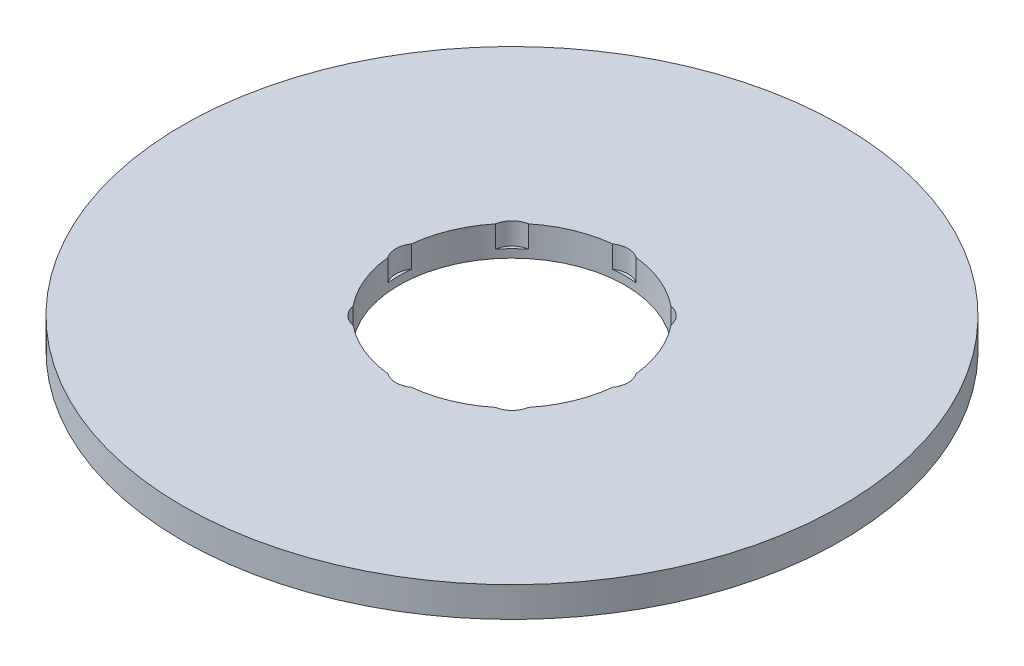
ISO-10303-21;
HEADER;
FILE_DESCRIPTION(('STEP AP214'),'2;1');
FILE_NAME('part.step','',(''),(''),'','','');
FILE_SCHEMA(('AUTOMOTIVE_DESIGN { 1 0 10303 214 1 1 1 1 }'));
ENDSEC;
DATA;
#1=APPLICATION_CONTEXT('core data for automotive mechanical design processes');
#2=APPLICATION_PROTOCOL_DEFINITION('international standard','automotive_design',2000,#1);
#3=PRODUCT_CONTEXT('',#1,'mechanical');
#4=PRODUCT('Part','Part','',(#3));
#5=PRODUCT_RELATED_PRODUCT_CATEGORY('part','',(#4));
#6=PRODUCT_DEFINITION_FORMATION('','',#4);
#7=PRODUCT_DEFINITION_CONTEXT('part definition',#1,'design');
#8=PRODUCT_DEFINITION('design','',#6,#7);
#9=PRODUCT_DEFINITION_SHAPE('','',#8);
#10=(LENGTH_UNIT() NAMED_UNIT(*) SI_UNIT(.MILLI.,.METRE.));
#11=(NAMED_UNIT(*) PLANE_ANGLE_UNIT() SI_UNIT($,.RADIAN.));
#12=(NAMED_UNIT(*) SI_UNIT($,.STERADIAN.) SOLID_ANGLE_UNIT());
#13=UNCERTAINTY_MEASURE_WITH_UNIT(LENGTH_MEASURE(1.E-05),#10,'distance_accuracy_value','');
#14=(GEOMETRIC_REPRESENTATION_CONTEXT(3) GLOBAL_UNCERTAINTY_ASSIGNED_CONTEXT((#13)) GLOBAL_UNIT_ASSIGNED_CONTEXT((#10,
#11,#12)) REPRESENTATION_CONTEXT('',''));
#15=CARTESIAN_POINT('',(0.,0.,0.));
#16=DIRECTION('',(0.,0.,1.));
#17=DIRECTION('',(1.,0.,0.));
#18=AXIS2_PLACEMENT_3D('',#15,#16,#17);
#19=CARTESIAN_POINT('',(0.,8.,0.));
#20=DIRECTION('',(0.,-1.,0.));
#21=DIRECTION('',(0.,0.,-1.));
#22=AXIS2_PLACEMENT_3D('',#19,#20,#21);
#23=CYLINDRICAL_SURFACE('',#22,87.5);
#24=CARTESIAN_POINT('',(0.,8.,0.));
#25=DIRECTION('',(0.,1.,0.));
#26=DIRECTION('',(0.,0.,1.));
#27=AXIS2_PLACEMENT_3D('',#24,#25,#26);
#28=CIRCLE('',#27,87.5);
#29=CARTESIAN_POINT('',(0.,8.,87.5));
#30=VERTEX_POINT('',#29);
#31=EDGE_CURVE('E183',#30,#30,#28,.T.);
#32=ORIENTED_EDGE('',*,*,#31,.F.);
#33=EDGE_LOOP('',(#32));
#34=FACE_BOUND('',#33,.T.);
#35=CARTESIAN_POINT('',(0.,0.,0.));
#36=DIRECTION('',(0.,1.,0.));
#37=DIRECTION('',(0.,0.,1.));
#38=AXIS2_PLACEMENT_3D('',#35,#36,#37);
#39=CIRCLE('',#38,87.5);
#40=CARTESIAN_POINT('',(0.,0.,87.5));
#41=VERTEX_POINT('',#40);
#42=EDGE_CURVE('E182',#41,#41,#39,.T.);
#43=ORIENTED_EDGE('',*,*,#42,.T.);
#44=EDGE_LOOP('',(#43));
#45=FACE_BOUND('',#44,.T.);
#46=ADVANCED_FACE('F39',(#34,#45),#23,.T.);
#47=CARTESIAN_POINT('',(0.,8.,0.));
#48=DIRECTION('',(0.,1.,0.));
#49=DIRECTION('',(0.,0.,1.));
#50=AXIS2_PLACEMENT_3D('',#47,#48,#49);
#51=PLANE('',#50);
#52=CARTESIAN_POINT('',(0.,8.,25.4752895395327));
#53=DIRECTION('',(0.,1.,0.));
#54=DIRECTION('',(1.,0.,0.));
#55=AXIS2_PLACEMENT_3D('',#52,#53,#54);
#56=CIRCLE('',#55,5.35674444251532);
#57=CARTESIAN_POINT('',(-3.10740063924162,8.,29.838633703091));
#58=VERTEX_POINT('',#57);
#59=CARTESIAN_POINT('',(3.10740063924183,8.,29.838633703091));
#60=VERTEX_POINT('',#59);
#61=EDGE_CURVE('E256',#58,#60,#56,.T.);
#62=ORIENTED_EDGE('',*,*,#61,.F.);
#63=CARTESIAN_POINT('',(0.,8.,0.));
#64=DIRECTION('',(0.,1.,0.));
#65=DIRECTION('',(0.,0.,1.));
#66=AXIS2_PLACEMENT_3D('',#63,#64,#65);
#67=CIRCLE('',#66,30.);
#68=CARTESIAN_POINT('',(-18.9018361689258,8.,23.2963642966684));
#69=VERTEX_POINT('',#68);
#70=EDGE_CURVE('E175',#69,#58,#67,.T.);
#71=ORIENTED_EDGE('',*,*,#70,.F.);
#72=CARTESIAN_POINT('',(-18.0137499860942,8.,18.0137499860943));
#73=DIRECTION('',(0.,1.,0.));
#74=DIRECTION('',(0.707106781186549,0.,0.707106781186546));
#75=AXIS2_PLACEMENT_3D('',#72,#73,#74);
#76=CIRCLE('',#75,5.35674444251532);
#77=CARTESIAN_POINT('',(-23.2963642966683,8.,18.9018361689259));
#78=VERTEX_POINT('',#77);
#79=EDGE_CURVE('E152',#78,#69,#76,.T.);
#80=ORIENTED_EDGE('',*,*,#79,.F.);
#81=CARTESIAN_POINT('',(-29.838633703091,8.,3.10740063924173));
#82=VERTEX_POINT('',#81);
#83=EDGE_CURVE('E168',#82,#78,#67,.T.);
#84=ORIENTED_EDGE('',*,*,#83,.F.);
#85=CARTESIAN_POINT('',(-25.4752895395327,8.,0.));
#86=DIRECTION('',(0.,1.,0.));
#87=DIRECTION('',(0.,0.,1.));
#88=AXIS2_PLACEMENT_3D('',#85,#86,#87);
#89=CIRCLE('',#88,5.35674444251532);
#90=CARTESIAN_POINT('',(-29.838633703091,8.,-3.10740063924173));
#91=VERTEX_POINT('',#90);
#92=EDGE_CURVE('E205',#91,#82,#89,.T.);
#93=ORIENTED_EDGE('',*,*,#92,.F.);
#94=CARTESIAN_POINT('',(-23.2963642966686,8.,-18.9018361689256));
#95=VERTEX_POINT('',#94);
#96=EDGE_CURVE('E181',#95,#91,#67,.T.);
#97=ORIENTED_EDGE('',*,*,#96,.F.);
#98=CARTESIAN_POINT('',(-18.0137499860945,8.,-18.013749986094));
#99=DIRECTION('',(0.,1.,0.));
#100=DIRECTION('',(-0.707106781186539,0.,0.707106781186556));
#101=AXIS2_PLACEMENT_3D('',#98,#99,#100);
#102=CIRCLE('',#101,5.35674444251532);
#103=CARTESIAN_POINT('',(-18.9018361689262,8.,-23.2963642966681));
#104=VERTEX_POINT('',#103);
#105=EDGE_CURVE('E453',#104,#95,#102,.T.);
#106=ORIENTED_EDGE('',*,*,#105,.F.);
#107=CARTESIAN_POINT('',(-3.10740063924204,8.,-29.838633703091));
#108=VERTEX_POINT('',#107);
#109=EDGE_CURVE('E189',#108,#104,#67,.T.);
#110=ORIENTED_EDGE('',*,*,#109,.F.);
#111=CARTESIAN_POINT('',(-2.66839494086712E-13,8.,-25.4752895395327));
#112=DIRECTION('',(0.,1.,0.));
#113=DIRECTION('',(-1.,0.,0.));
#114=AXIS2_PLACEMENT_3D('',#111,#112,#113);
#115=CIRCLE('',#114,5.35674444251532);
#116=CARTESIAN_POINT('',(3.10740063924142,8.,-29.8386337030911));
#117=VERTEX_POINT('',#116);
#118=EDGE_CURVE('E462',#117,#108,#115,.T.);
#119=ORIENTED_EDGE('',*,*,#118,.F.);
#120=CARTESIAN_POINT('',(18.9018361689257,8.,-23.2963642966685));
#121=VERTEX_POINT('',#120);
#122=EDGE_CURVE('E197',#121,#117,#67,.T.);
#123=ORIENTED_EDGE('',*,*,#122,.F.);
#124=CARTESIAN_POINT('',(18.0137499860941,8.,-18.0137499860944));
#125=DIRECTION('',(0.,1.,0.));
#126=DIRECTION('',(-0.707106781186554,0.,-0.707106781186541));
#127=AXIS2_PLACEMENT_3D('',#124,#125,#126);
#128=CIRCLE('',#127,5.35674444251532);
#129=CARTESIAN_POINT('',(23.2963642966682,8.,-18.9018361689261));
#130=VERTEX_POINT('',#129);
#131=EDGE_CURVE('E470',#130,#121,#128,.T.);
#132=ORIENTED_EDGE('',*,*,#131,.F.);
#133=CARTESIAN_POINT('',(29.838633703091,8.,-3.10740063924173));
#134=VERTEX_POINT('',#133);
#135=EDGE_CURVE('E489',#134,#130,#67,.T.);
#136=ORIENTED_EDGE('',*,*,#135,.F.);
#137=CARTESIAN_POINT('',(25.4752895395327,8.,0.));
#138=DIRECTION('',(0.,1.,0.));
#139=DIRECTION('',(0.,0.,-1.));
#140=AXIS2_PLACEMENT_3D('',#137,#138,#139);
#141=CIRCLE('',#140,5.35674444251532);
#142=CARTESIAN_POINT('',(29.838633703091,8.,3.10740063924173));
#143=VERTEX_POINT('',#142);
#144=EDGE_CURVE('E476',#143,#134,#141,.T.);
#145=ORIENTED_EDGE('',*,*,#144,.F.);
#146=CARTESIAN_POINT('',(23.2963642966685,8.,18.9018361689258));
#147=VERTEX_POINT('',#146);
#148=EDGE_CURVE('E491',#147,#143,#67,.T.);
#149=ORIENTED_EDGE('',*,*,#148,.F.);
#150=CARTESIAN_POINT('',(18.0137499860944,8.,18.0137499860942));
#151=DIRECTION('',(0.,1.,0.));
#152=DIRECTION('',(0.707106781186544,0.,-0.707106781186551));
#153=AXIS2_PLACEMENT_3D('',#150,#151,#152);
#154=CIRCLE('',#153,5.35674444251532);
#155=CARTESIAN_POINT('',(18.901836168926,8.,23.2963642966683));
#156=VERTEX_POINT('',#155);
#157=EDGE_CURVE('E475',#156,#147,#154,.T.);
#158=ORIENTED_EDGE('',*,*,#157,.F.);
#159=EDGE_CURVE('E190',#60,#156,#67,.T.);
#160=ORIENTED_EDGE('',*,*,#159,.F.);
#161=EDGE_LOOP('',(#62,#71,#80,#84,#93,#97,#106,#110,#119,#123,#132,#136,#145,#149,#158,#160));
#162=FACE_BOUND('',#161,.T.);
#163=ORIENTED_EDGE('',*,*,#31,.T.);
#164=EDGE_LOOP('',(#163));
#165=FACE_BOUND('',#164,.T.);
#166=ADVANCED_FACE('F170',(#162,#165),#51,.T.);
#167=CARTESIAN_POINT('',(0.,0.,0.));
#168=DIRECTION('',(0.,1.,0.));
#169=DIRECTION('',(0.,0.,1.));
#170=AXIS2_PLACEMENT_3D('',#167,#168,#169);
#171=PLANE('',#170);
#172=CARTESIAN_POINT('',(0.,0.,0.));
#173=DIRECTION('',(0.,1.,0.));
#174=DIRECTION('',(0.,0.,1.));
#175=AXIS2_PLACEMENT_3D('',#172,#173,#174);
#176=CIRCLE('',#175,30.);
#177=CARTESIAN_POINT('',(0.,0.,30.));
#178=VERTEX_POINT('',#177);
#179=EDGE_CURVE('E191',#178,#178,#176,.T.);
#180=ORIENTED_EDGE('',*,*,#179,.T.);
#181=EDGE_LOOP('',(#180));
#182=FACE_BOUND('',#181,.T.);
#183=ORIENTED_EDGE('',*,*,#42,.F.);
#184=EDGE_LOOP('',(#183));
#185=FACE_BOUND('',#184,.T.);
#186=ADVANCED_FACE('F277',(#182,#185),#171,.F.);
#187=CARTESIAN_POINT('',(0.,8.,0.));
#188=DIRECTION('',(0.,-1.,0.));
#189=DIRECTION('',(0.,0.,-1.));
#190=AXIS2_PLACEMENT_3D('',#187,#188,#189);
#191=CYLINDRICAL_SURFACE('',#190,30.);
#192=DIRECTION('',(0.,1.,0.));
#193=VECTOR('',#192,1.);
#194=CARTESIAN_POINT('',(-3.10740063924164,5.08695155469688,29.838633703091));
#195=LINE('',#194,#193);
#196=CARTESIAN_POINT('',(-3.10740063924162,2.17390310939375,29.838633703091));
#197=VERTEX_POINT('',#196);
#198=EDGE_CURVE('E11',#197,#58,#195,.T.);
#199=ORIENTED_EDGE('',*,*,#198,.F.);
#200=CARTESIAN_POINT('',(0.,2.17390310939375,0.));
#201=DIRECTION('',(0.,1.,0.));
#202=DIRECTION('',(0.,0.,1.));
#203=AXIS2_PLACEMENT_3D('',#200,#201,#202);
#204=CIRCLE('',#203,30.);
#205=CARTESIAN_POINT('',(3.10740063924183,2.17390310939375,29.838633703091));
#206=VERTEX_POINT('',#205);
#207=EDGE_CURVE('E251',#197,#206,#204,.T.);
#208=ORIENTED_EDGE('',*,*,#207,.T.);
#209=DIRECTION('',(0.,1.,0.));
#210=VECTOR('',#209,1.);
#211=CARTESIAN_POINT('',(3.10740063924185,5.08695155469688,29.838633703091));
#212=LINE('',#211,#210);
#213=EDGE_CURVE('E46',#60,#206,#212,.F.);
#214=ORIENTED_EDGE('',*,*,#213,.F.);
#215=ORIENTED_EDGE('',*,*,#159,.T.);
#216=DIRECTION('',(0.,1.,0.));
#217=VECTOR('',#216,1.);
#218=CARTESIAN_POINT('',(18.901836168926,5.08695155469688,23.2963642966683));
#219=LINE('',#218,#217);
#220=CARTESIAN_POINT('',(18.901836168926,2.17390310939375,23.2963642966683));
#221=VERTEX_POINT('',#220);
#222=EDGE_CURVE('E253',#221,#156,#219,.T.);
#223=ORIENTED_EDGE('',*,*,#222,.F.);
#224=CARTESIAN_POINT('',(0.,2.17390310939375,0.));
#225=DIRECTION('',(0.,1.,0.));
#226=DIRECTION('',(0.,0.,1.));
#227=AXIS2_PLACEMENT_3D('',#224,#225,#226);
#228=CIRCLE('',#227,30.);
#229=CARTESIAN_POINT('',(23.2963642966685,2.17390310939375,18.9018361689258));
#230=VERTEX_POINT('',#229);
#231=EDGE_CURVE('E246',#221,#230,#228,.T.);
#232=ORIENTED_EDGE('',*,*,#231,.T.);
#233=DIRECTION('',(0.,1.,0.));
#234=VECTOR('',#233,1.);
#235=CARTESIAN_POINT('',(23.2963642966685,5.08695155469688,18.9018361689258));
#236=LINE('',#235,#234);
#237=EDGE_CURVE('E248',#147,#230,#236,.F.);
#238=ORIENTED_EDGE('',*,*,#237,.F.);
#239=ORIENTED_EDGE('',*,*,#148,.T.);
#240=DIRECTION('',(0.,1.,0.));
#241=VECTOR('',#240,1.);
#242=CARTESIAN_POINT('',(29.838633703091,5.08695155469688,3.10740063924174));
#243=LINE('',#242,#241);
#244=CARTESIAN_POINT('',(29.838633703091,2.17390310939375,3.10740063924173));
#245=VERTEX_POINT('',#244);
#246=EDGE_CURVE('E243',#245,#143,#243,.T.);
#247=ORIENTED_EDGE('',*,*,#246,.F.);
#248=CARTESIAN_POINT('',(0.,2.17390310939375,0.));
#249=DIRECTION('',(0.,1.,0.));
#250=DIRECTION('',(0.,0.,1.));
#251=AXIS2_PLACEMENT_3D('',#248,#249,#250);
#252=CIRCLE('',#251,30.);
#253=CARTESIAN_POINT('',(29.838633703091,2.17390310939375,-3.10740063924173));
#254=VERTEX_POINT('',#253);
#255=EDGE_CURVE('E236',#245,#254,#252,.T.);
#256=ORIENTED_EDGE('',*,*,#255,.T.);
#257=DIRECTION('',(0.,1.,0.));
#258=VECTOR('',#257,1.);
#259=CARTESIAN_POINT('',(29.838633703091,5.08695155469688,-3.10740063924174));
#260=LINE('',#259,#258);
#261=EDGE_CURVE('E241',#134,#254,#260,.F.);
#262=ORIENTED_EDGE('',*,*,#261,.F.);
#263=ORIENTED_EDGE('',*,*,#135,.T.);
#264=DIRECTION('',(0.,1.,0.));
#265=VECTOR('',#264,1.);
#266=CARTESIAN_POINT('',(23.2963642966682,5.08695155469688,-18.9018361689261));
#267=LINE('',#266,#265);
#268=CARTESIAN_POINT('',(23.2963642966682,2.17390310939375,-18.9018361689261));
#269=VERTEX_POINT('',#268);
#270=EDGE_CURVE('E237',#269,#130,#267,.T.);
#271=ORIENTED_EDGE('',*,*,#270,.F.);
#272=CARTESIAN_POINT('',(0.,2.17390310939375,0.));
#273=DIRECTION('',(0.,1.,0.));
#274=DIRECTION('',(0.,0.,1.));
#275=AXIS2_PLACEMENT_3D('',#272,#273,#274);
#276=CIRCLE('',#275,30.);
#277=CARTESIAN_POINT('',(18.9018361689257,2.17390310939375,-23.2963642966685));
#278=VERTEX_POINT('',#277);
#279=EDGE_CURVE('E229',#269,#278,#276,.T.);
#280=ORIENTED_EDGE('',*,*,#279,.T.);
#281=DIRECTION('',(0.,1.,0.));
#282=VECTOR('',#281,1.);
#283=CARTESIAN_POINT('',(18.9018361689257,5.08695155469688,-23.2963642966685));
#284=LINE('',#283,#282);
#285=EDGE_CURVE('E232',#121,#278,#284,.F.);
#286=ORIENTED_EDGE('',*,*,#285,.F.);
#287=ORIENTED_EDGE('',*,*,#122,.T.);
#288=DIRECTION('',(0.,1.,0.));
#289=VECTOR('',#288,1.);
#290=CARTESIAN_POINT('',(3.10740063924143,5.08695155469688,-29.8386337030911));
#291=LINE('',#290,#289);
#292=CARTESIAN_POINT('',(3.10740063924142,2.17390310939375,-29.8386337030911));
#293=VERTEX_POINT('',#292);
#294=EDGE_CURVE('E227',#293,#117,#291,.T.);
#295=ORIENTED_EDGE('',*,*,#294,.F.);
#296=CARTESIAN_POINT('',(0.,2.17390310939375,0.));
#297=DIRECTION('',(0.,1.,0.));
#298=DIRECTION('',(0.,0.,1.));
#299=AXIS2_PLACEMENT_3D('',#296,#297,#298);
#300=CIRCLE('',#299,30.);
#301=CARTESIAN_POINT('',(-3.10740063924204,2.17390310939375,-29.838633703091));
#302=VERTEX_POINT('',#301);
#303=EDGE_CURVE('E225',#293,#302,#300,.T.);
#304=ORIENTED_EDGE('',*,*,#303,.T.);
#305=DIRECTION('',(0.,1.,0.));
#306=VECTOR('',#305,1.);
#307=CARTESIAN_POINT('',(-3.10740063924206,5.08695155469688,-29.838633703091));
#308=LINE('',#307,#306);
#309=EDGE_CURVE('E223',#108,#302,#308,.F.);
#310=ORIENTED_EDGE('',*,*,#309,.F.);
#311=ORIENTED_EDGE('',*,*,#109,.T.);
#312=DIRECTION('',(0.,1.,0.));
#313=VECTOR('',#312,1.);
#314=CARTESIAN_POINT('',(-18.9018361689262,5.08695155469688,-23.2963642966681));
#315=LINE('',#314,#313);
#316=CARTESIAN_POINT('',(-18.9018361689262,2.17390310939375,-23.2963642966681));
#317=VERTEX_POINT('',#316);
#318=EDGE_CURVE('E219',#317,#104,#315,.T.);
#319=ORIENTED_EDGE('',*,*,#318,.F.);
#320=CARTESIAN_POINT('',(0.,2.17390310939375,0.));
#321=DIRECTION('',(0.,1.,0.));
#322=DIRECTION('',(0.,0.,1.));
#323=AXIS2_PLACEMENT_3D('',#320,#321,#322);
#324=CIRCLE('',#323,30.);
#325=CARTESIAN_POINT('',(-23.2963642966686,2.17390310939375,-18.9018361689256));
#326=VERTEX_POINT('',#325);
#327=EDGE_CURVE('E159',#317,#326,#324,.T.);
#328=ORIENTED_EDGE('',*,*,#327,.T.);
#329=DIRECTION('',(0.,1.,0.));
#330=VECTOR('',#329,1.);
#331=CARTESIAN_POINT('',(-23.2963642966686,5.08695155469688,-18.9018361689256));
#332=LINE('',#331,#330);
#333=EDGE_CURVE('E220',#95,#326,#332,.F.);
#334=ORIENTED_EDGE('',*,*,#333,.F.);
#335=ORIENTED_EDGE('',*,*,#96,.T.);
#336=DIRECTION('',(0.,1.,0.));
#337=VECTOR('',#336,1.);
#338=CARTESIAN_POINT('',(-29.838633703091,5.08695155469688,-3.10740063924174));
#339=LINE('',#338,#337);
#340=CARTESIAN_POINT('',(-29.838633703091,2.17390310939375,-3.10740063924173));
#341=VERTEX_POINT('',#340);
#342=EDGE_CURVE('E209',#341,#91,#339,.T.);
#343=ORIENTED_EDGE('',*,*,#342,.F.);
#344=CARTESIAN_POINT('',(0.,2.17390310939375,0.));
#345=DIRECTION('',(0.,1.,0.));
#346=DIRECTION('',(0.,0.,1.));
#347=AXIS2_PLACEMENT_3D('',#344,#345,#346);
#348=CIRCLE('',#347,30.);
#349=CARTESIAN_POINT('',(-29.838633703091,2.17390310939375,3.10740063924173));
#350=VERTEX_POINT('',#349);
#351=EDGE_CURVE('E206',#341,#350,#348,.T.);
#352=ORIENTED_EDGE('',*,*,#351,.T.);
#353=DIRECTION('',(0.,1.,0.));
#354=VECTOR('',#353,1.);
#355=CARTESIAN_POINT('',(-29.838633703091,5.08695155469688,3.10740063924174));
#356=LINE('',#355,#354);
#357=EDGE_CURVE('E179',#82,#350,#356,.F.);
#358=ORIENTED_EDGE('',*,*,#357,.F.);
#359=ORIENTED_EDGE('',*,*,#83,.T.);
#360=DIRECTION('',(0.,1.,0.));
#361=VECTOR('',#360,1.);
#362=CARTESIAN_POINT('',(-23.2963642966683,5.08695155469688,18.9018361689259));
#363=LINE('',#362,#361);
#364=CARTESIAN_POINT('',(-23.2963642966683,2.17390310939375,18.9018361689259));
#365=VERTEX_POINT('',#364);
#366=EDGE_CURVE('E147',#365,#78,#363,.T.);
#367=ORIENTED_EDGE('',*,*,#366,.F.);
#368=CARTESIAN_POINT('',(0.,2.17390310939375,0.));
#369=DIRECTION('',(0.,1.,0.));
#370=DIRECTION('',(0.,0.,1.));
#371=AXIS2_PLACEMENT_3D('',#368,#369,#370);
#372=CIRCLE('',#371,30.);
#373=CARTESIAN_POINT('',(-18.9018361689258,2.17390310939375,23.2963642966684));
#374=VERTEX_POINT('',#373);
#375=EDGE_CURVE('E215',#365,#374,#372,.T.);
#376=ORIENTED_EDGE('',*,*,#375,.T.);
#377=DIRECTION('',(0.,1.,0.));
#378=VECTOR('',#377,1.);
#379=CARTESIAN_POINT('',(-18.9018361689258,5.08695155469688,23.2963642966684));
#380=LINE('',#379,#378);
#381=EDGE_CURVE('E161',#69,#374,#380,.F.);
#382=ORIENTED_EDGE('',*,*,#381,.F.);
#383=ORIENTED_EDGE('',*,*,#70,.T.);
#384=EDGE_LOOP('',(#199,#208,#214,#215,#223,#232,#238,#239,#247,#256,#262,#263,#271,#280,#286,
#287,#295,#304,#310,#311,#319,#328,#334,#335,#343,#352,#358,#359,#367,#376,#382,#383));
#385=FACE_BOUND('',#384,.T.);
#386=ORIENTED_EDGE('',*,*,#179,.F.);
#387=EDGE_LOOP('',(#386));
#388=FACE_BOUND('',#387,.T.);
#389=ADVANCED_FACE('F176',(#385,#388),#191,.F.);
#390=CARTESIAN_POINT('',(-25.4752895395327,2.17390310939375,0.));
#391=DIRECTION('',(0.,1.,0.));
#392=DIRECTION('',(0.,0.,1.));
#393=AXIS2_PLACEMENT_3D('',#390,#391,#392);
#394=CYLINDRICAL_SURFACE('',#393,5.35674444251532);
#395=ORIENTED_EDGE('',*,*,#342,.T.);
#396=ORIENTED_EDGE('',*,*,#92,.T.);
#397=ORIENTED_EDGE('',*,*,#357,.T.);
#398=CARTESIAN_POINT('',(-25.4752895395327,2.17390310939375,0.));
#399=DIRECTION('',(0.,1.,0.));
#400=DIRECTION('',(0.,0.,1.));
#401=AXIS2_PLACEMENT_3D('',#398,#399,#400);
#402=CIRCLE('',#401,5.35674444251532);
#403=EDGE_CURVE('E200',#341,#350,#402,.T.);
#404=ORIENTED_EDGE('',*,*,#403,.F.);
#405=EDGE_LOOP('',(#395,#396,#397,#404));
#406=FACE_BOUND('',#405,.T.);
#407=ADVANCED_FACE('F286',(#406),#394,.F.);
#408=CARTESIAN_POINT('',(-25.4752895395327,2.17390310939375,0.));
#409=DIRECTION('',(0.,1.,0.));
#410=DIRECTION('',(0.,0.,1.));
#411=AXIS2_PLACEMENT_3D('',#408,#409,#410);
#412=PLANE('',#411);
#413=ORIENTED_EDGE('',*,*,#403,.T.);
#414=ORIENTED_EDGE('',*,*,#351,.F.);
#415=EDGE_LOOP('',(#413,#414));
#416=FACE_BOUND('',#415,.T.);
#417=ADVANCED_FACE('F289',(#416),#412,.T.);
#418=CARTESIAN_POINT('',(-18.0137499860942,2.17390310939375,18.0137499860943));
#419=DIRECTION('',(0.,1.,0.));
#420=DIRECTION('',(0.,0.,1.));
#421=AXIS2_PLACEMENT_3D('',#418,#419,#420);
#422=CYLINDRICAL_SURFACE('',#421,5.35674444251532);
#423=ORIENTED_EDGE('',*,*,#366,.T.);
#424=ORIENTED_EDGE('',*,*,#79,.T.);
#425=ORIENTED_EDGE('',*,*,#381,.T.);
#426=CARTESIAN_POINT('',(-18.0137499860942,2.17390310939375,18.0137499860943));
#427=DIRECTION('',(0.,1.,0.));
#428=DIRECTION('',(0.707106781186549,0.,0.707106781186546));
#429=AXIS2_PLACEMENT_3D('',#426,#427,#428);
#430=CIRCLE('',#429,5.35674444251532);
#431=EDGE_CURVE('E156',#365,#374,#430,.T.);
#432=ORIENTED_EDGE('',*,*,#431,.F.);
#433=EDGE_LOOP('',(#423,#424,#425,#432));
#434=FACE_BOUND('',#433,.T.);
#435=ADVANCED_FACE('F155',(#434),#422,.F.);
#436=CARTESIAN_POINT('',(-18.0137499860942,2.17390310939375,18.0137499860943));
#437=DIRECTION('',(0.,1.,0.));
#438=DIRECTION('',(0.707106781186549,0.,0.707106781186546));
#439=AXIS2_PLACEMENT_3D('',#436,#437,#438);
#440=PLANE('',#439);
#441=ORIENTED_EDGE('',*,*,#431,.T.);
#442=ORIENTED_EDGE('',*,*,#375,.F.);
#443=EDGE_LOOP('',(#441,#442));
#444=FACE_BOUND('',#443,.T.);
#445=ADVANCED_FACE('F300',(#444),#440,.T.);
#446=CARTESIAN_POINT('',(-18.0137499860945,2.17390310939375,-18.013749986094));
#447=DIRECTION('',(0.,1.,0.));
#448=DIRECTION('',(0.,0.,1.));
#449=AXIS2_PLACEMENT_3D('',#446,#447,#448);
#450=CYLINDRICAL_SURFACE('',#449,5.35674444251532);
#451=ORIENTED_EDGE('',*,*,#318,.T.);
#452=ORIENTED_EDGE('',*,*,#105,.T.);
#453=ORIENTED_EDGE('',*,*,#333,.T.);
#454=CARTESIAN_POINT('',(-18.0137499860945,2.17390310939375,-18.013749986094));
#455=DIRECTION('',(0.,1.,0.));
#456=DIRECTION('',(-0.707106781186539,0.,0.707106781186556));
#457=AXIS2_PLACEMENT_3D('',#454,#455,#456);
#458=CIRCLE('',#457,5.35674444251532);
#459=EDGE_CURVE('E454',#317,#326,#458,.T.);
#460=ORIENTED_EDGE('',*,*,#459,.F.);
#461=EDGE_LOOP('',(#451,#452,#453,#460));
#462=FACE_BOUND('',#461,.T.);
#463=ADVANCED_FACE('F299',(#462),#450,.F.);
#464=CARTESIAN_POINT('',(-18.0137499860945,2.17390310939375,-18.013749986094));
#465=DIRECTION('',(0.,1.,0.));
#466=DIRECTION('',(-0.707106781186539,0.,0.707106781186556));
#467=AXIS2_PLACEMENT_3D('',#464,#465,#466);
#468=PLANE('',#467);
#469=ORIENTED_EDGE('',*,*,#459,.T.);
#470=ORIENTED_EDGE('',*,*,#327,.F.);
#471=EDGE_LOOP('',(#469,#470));
#472=FACE_BOUND('',#471,.T.);
#473=ADVANCED_FACE('F379',(#472),#468,.T.);
#474=CARTESIAN_POINT('',(-2.66839494086712E-13,2.17390310939375,-25.4752895395327));
#475=DIRECTION('',(0.,1.,0.));
#476=DIRECTION('',(0.,0.,1.));
#477=AXIS2_PLACEMENT_3D('',#474,#475,#476);
#478=CYLINDRICAL_SURFACE('',#477,5.35674444251532);
#479=ORIENTED_EDGE('',*,*,#294,.T.);
#480=ORIENTED_EDGE('',*,*,#118,.T.);
#481=ORIENTED_EDGE('',*,*,#309,.T.);
#482=CARTESIAN_POINT('',(-2.66839494086712E-13,2.17390310939375,-25.4752895395327));
#483=DIRECTION('',(0.,1.,0.));
#484=DIRECTION('',(-1.,0.,0.));
#485=AXIS2_PLACEMENT_3D('',#482,#483,#484);
#486=CIRCLE('',#485,5.35674444251532);
#487=EDGE_CURVE('E465',#293,#302,#486,.T.);
#488=ORIENTED_EDGE('',*,*,#487,.F.);
#489=EDGE_LOOP('',(#479,#480,#481,#488));
#490=FACE_BOUND('',#489,.T.);
#491=ADVANCED_FACE('F371',(#490),#478,.F.);
#492=CARTESIAN_POINT('',(-2.66839494086712E-13,2.17390310939375,-25.4752895395327));
#493=DIRECTION('',(0.,1.,0.));
#494=DIRECTION('',(-1.,0.,0.));
#495=AXIS2_PLACEMENT_3D('',#492,#493,#494);
#496=PLANE('',#495);
#497=ORIENTED_EDGE('',*,*,#487,.T.);
#498=ORIENTED_EDGE('',*,*,#303,.F.);
#499=EDGE_LOOP('',(#497,#498));
#500=FACE_BOUND('',#499,.T.);
#501=ADVANCED_FACE('F308',(#500),#496,.T.);
#502=CARTESIAN_POINT('',(18.0137499860941,2.17390310939375,-18.0137499860944));
#503=DIRECTION('',(0.,1.,0.));
#504=DIRECTION('',(0.,0.,1.));
#505=AXIS2_PLACEMENT_3D('',#502,#503,#504);
#506=CYLINDRICAL_SURFACE('',#505,5.35674444251532);
#507=ORIENTED_EDGE('',*,*,#270,.T.);
#508=ORIENTED_EDGE('',*,*,#131,.T.);
#509=ORIENTED_EDGE('',*,*,#285,.T.);
#510=CARTESIAN_POINT('',(18.0137499860941,2.17390310939375,-18.0137499860944));
#511=DIRECTION('',(0.,1.,0.));
#512=DIRECTION('',(-0.707106781186554,0.,-0.707106781186541));
#513=AXIS2_PLACEMENT_3D('',#510,#511,#512);
#514=CIRCLE('',#513,5.35674444251532);
#515=EDGE_CURVE('E477',#269,#278,#514,.T.);
#516=ORIENTED_EDGE('',*,*,#515,.F.);
#517=EDGE_LOOP('',(#507,#508,#509,#516));
#518=FACE_BOUND('',#517,.T.);
#519=ADVANCED_FACE('F305',(#518),#506,.F.);
#520=CARTESIAN_POINT('',(18.0137499860941,2.17390310939375,-18.0137499860944));
#521=DIRECTION('',(0.,1.,0.));
#522=DIRECTION('',(-0.707106781186554,0.,-0.707106781186541));
#523=AXIS2_PLACEMENT_3D('',#520,#521,#522);
#524=PLANE('',#523);
#525=ORIENTED_EDGE('',*,*,#515,.T.);
#526=ORIENTED_EDGE('',*,*,#279,.F.);
#527=EDGE_LOOP('',(#525,#526));
#528=FACE_BOUND('',#527,.T.);
#529=ADVANCED_FACE('F304',(#528),#524,.T.);
#530=CARTESIAN_POINT('',(25.4752895395327,2.17390310939375,0.));
#531=DIRECTION('',(0.,1.,0.));
#532=DIRECTION('',(0.,0.,1.));
#533=AXIS2_PLACEMENT_3D('',#530,#531,#532);
#534=CYLINDRICAL_SURFACE('',#533,5.35674444251532);
#535=ORIENTED_EDGE('',*,*,#246,.T.);
#536=ORIENTED_EDGE('',*,*,#144,.T.);
#537=ORIENTED_EDGE('',*,*,#261,.T.);
#538=CARTESIAN_POINT('',(25.4752895395327,2.17390310939375,0.));
#539=DIRECTION('',(0.,1.,0.));
#540=DIRECTION('',(0.,0.,-1.));
#541=AXIS2_PLACEMENT_3D('',#538,#539,#540);
#542=CIRCLE('',#541,5.35674444251532);
#543=EDGE_CURVE('E478',#245,#254,#542,.T.);
#544=ORIENTED_EDGE('',*,*,#543,.F.);
#545=EDGE_LOOP('',(#535,#536,#537,#544));
#546=FACE_BOUND('',#545,.T.);
#547=ADVANCED_FACE('F309',(#546),#534,.F.);
#548=CARTESIAN_POINT('',(25.4752895395327,2.17390310939375,0.));
#549=DIRECTION('',(0.,1.,0.));
#550=DIRECTION('',(0.,0.,-1.));
#551=AXIS2_PLACEMENT_3D('',#548,#549,#550);
#552=PLANE('',#551);
#553=ORIENTED_EDGE('',*,*,#543,.T.);
#554=ORIENTED_EDGE('',*,*,#255,.F.);
#555=EDGE_LOOP('',(#553,#554));
#556=FACE_BOUND('',#555,.T.);
#557=ADVANCED_FACE('F314',(#556),#552,.T.);
#558=CARTESIAN_POINT('',(18.0137499860944,2.17390310939375,18.0137499860942));
#559=DIRECTION('',(0.,1.,0.));
#560=DIRECTION('',(0.,0.,1.));
#561=AXIS2_PLACEMENT_3D('',#558,#559,#560);
#562=CYLINDRICAL_SURFACE('',#561,5.35674444251532);
#563=ORIENTED_EDGE('',*,*,#222,.T.);
#564=ORIENTED_EDGE('',*,*,#157,.T.);
#565=ORIENTED_EDGE('',*,*,#237,.T.);
#566=CARTESIAN_POINT('',(18.0137499860944,2.17390310939375,18.0137499860942));
#567=DIRECTION('',(0.,1.,0.));
#568=DIRECTION('',(0.707106781186544,0.,-0.707106781186551));
#569=AXIS2_PLACEMENT_3D('',#566,#567,#568);
#570=CIRCLE('',#569,5.35674444251532);
#571=EDGE_CURVE('E56',#221,#230,#570,.T.);
#572=ORIENTED_EDGE('',*,*,#571,.F.);
#573=EDGE_LOOP('',(#563,#564,#565,#572));
#574=FACE_BOUND('',#573,.T.);
#575=ADVANCED_FACE('F318',(#574),#562,.F.);
#576=CARTESIAN_POINT('',(18.0137499860944,2.17390310939375,18.0137499860942));
#577=DIRECTION('',(0.,1.,0.));
#578=DIRECTION('',(0.707106781186544,0.,-0.707106781186551));
#579=AXIS2_PLACEMENT_3D('',#576,#577,#578);
#580=PLANE('',#579);
#581=ORIENTED_EDGE('',*,*,#571,.T.);
#582=ORIENTED_EDGE('',*,*,#231,.F.);
#583=EDGE_LOOP('',(#581,#582));
#584=FACE_BOUND('',#583,.T.);
#585=ADVANCED_FACE('F270',(#584),#580,.T.);
#586=CARTESIAN_POINT('',(0.,2.17390310939375,25.4752895395327));
#587=DIRECTION('',(0.,1.,0.));
#588=DIRECTION('',(0.,0.,1.));
#589=AXIS2_PLACEMENT_3D('',#586,#587,#588);
#590=CYLINDRICAL_SURFACE('',#589,5.35674444251532);
#591=ORIENTED_EDGE('',*,*,#198,.T.);
#592=ORIENTED_EDGE('',*,*,#61,.T.);
#593=ORIENTED_EDGE('',*,*,#213,.T.);
#594=CARTESIAN_POINT('',(0.,2.17390310939375,25.4752895395327));
#595=DIRECTION('',(0.,1.,0.));
#596=DIRECTION('',(1.,0.,0.));
#597=AXIS2_PLACEMENT_3D('',#594,#595,#596);
#598=CIRCLE('',#597,5.35674444251532);
#599=EDGE_CURVE('E55',#197,#206,#598,.T.);
#600=ORIENTED_EDGE('',*,*,#599,.F.);
#601=EDGE_LOOP('',(#591,#592,#593,#600));
#602=FACE_BOUND('',#601,.T.);
#603=ADVANCED_FACE('F260',(#602),#590,.F.);
#604=CARTESIAN_POINT('',(0.,2.17390310939375,25.4752895395327));
#605=DIRECTION('',(0.,1.,0.));
#606=DIRECTION('',(1.,0.,0.));
#607=AXIS2_PLACEMENT_3D('',#604,#605,#606);
#608=PLANE('',#607);
#609=ORIENTED_EDGE('',*,*,#599,.T.);
#610=ORIENTED_EDGE('',*,*,#207,.F.);
#611=EDGE_LOOP('',(#609,#610));
#612=FACE_BOUND('',#611,.T.);
#613=ADVANCED_FACE('F261',(#612),#608,.T.);
#614=CLOSED_SHELL('',(#46,#166,#186,#389,#407,#417,#435,#445,#463,#473,#491,#501,#519,#529,#547,
#557,#575,#585,#603,#613));
#615=MANIFOLD_SOLID_BREP('B2',#614);
#616=ADVANCED_BREP_SHAPE_REPRESENTATION('',(#18,#615),#14);
#617=SHAPE_DEFINITION_REPRESENTATION(#9,#616);
ENDSEC;
END-ISO-10303-21;
